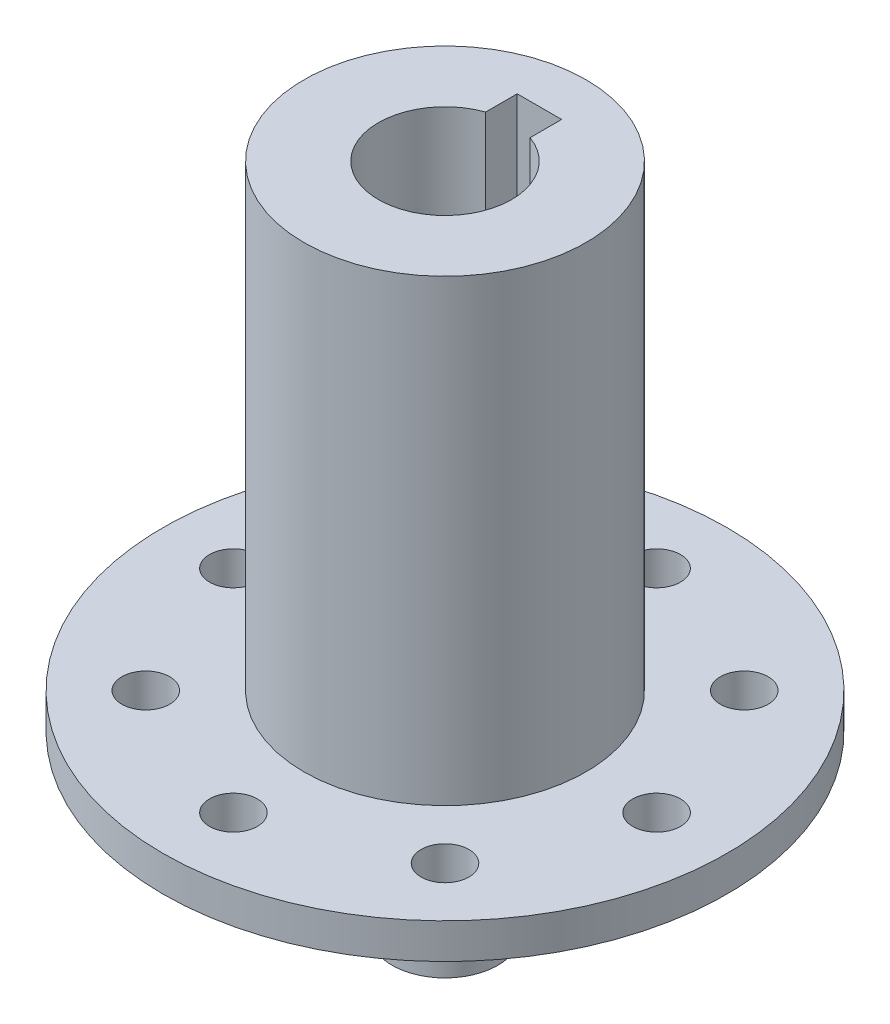
ISO-10303-21;
HEADER;
FILE_DESCRIPTION(('STEP AP214'),'2;1');
FILE_NAME('part.step','',(''),(''),'','','');
FILE_SCHEMA(('AUTOMOTIVE_DESIGN { 1 0 10303 214 1 1 1 1 }'));
ENDSEC;
DATA;
#1=APPLICATION_CONTEXT('core data for automotive mechanical design processes');
#2=APPLICATION_PROTOCOL_DEFINITION('international standard','automotive_design',2000,#1);
#3=PRODUCT_CONTEXT('',#1,'mechanical');
#4=PRODUCT('Part','Part','',(#3));
#5=PRODUCT_RELATED_PRODUCT_CATEGORY('part','',(#4));
#6=PRODUCT_DEFINITION_FORMATION('','',#4);
#7=PRODUCT_DEFINITION_CONTEXT('part definition',#1,'design');
#8=PRODUCT_DEFINITION('design','',#6,#7);
#9=PRODUCT_DEFINITION_SHAPE('','',#8);
#10=(LENGTH_UNIT() NAMED_UNIT(*) SI_UNIT(.MILLI.,.METRE.));
#11=(NAMED_UNIT(*) PLANE_ANGLE_UNIT() SI_UNIT($,.RADIAN.));
#12=(NAMED_UNIT(*) SI_UNIT($,.STERADIAN.) SOLID_ANGLE_UNIT());
#13=UNCERTAINTY_MEASURE_WITH_UNIT(LENGTH_MEASURE(1.E-05),#10,'distance_accuracy_value','');
#14=(GEOMETRIC_REPRESENTATION_CONTEXT(3) GLOBAL_UNCERTAINTY_ASSIGNED_CONTEXT((#13)) GLOBAL_UNIT_ASSIGNED_CONTEXT((#10,
#11,#12)) REPRESENTATION_CONTEXT('',''));
#15=CARTESIAN_POINT('',(0.,0.,0.));
#16=DIRECTION('',(0.,0.,1.));
#17=DIRECTION('',(1.,0.,0.));
#18=AXIS2_PLACEMENT_3D('',#15,#16,#17);
#19=CARTESIAN_POINT('',(0.,41.275,0.));
#20=DIRECTION('',(0.,-1.,0.));
#21=DIRECTION('',(0.,0.,-1.));
#22=AXIS2_PLACEMENT_3D('',#19,#20,#21);
#23=CYLINDRICAL_SURFACE('',#22,12.7);
#24=CARTESIAN_POINT('',(0.,41.275,0.));
#25=DIRECTION('',(0.,1.,0.));
#26=DIRECTION('',(0.,0.,1.));
#27=AXIS2_PLACEMENT_3D('',#24,#25,#26);
#28=CIRCLE('',#27,12.7);
#29=CARTESIAN_POINT('',(0.,41.275,12.7));
#30=VERTEX_POINT('',#29);
#31=EDGE_CURVE('E169',#30,#30,#28,.T.);
#32=ORIENTED_EDGE('',*,*,#31,.F.);
#33=EDGE_LOOP('',(#32));
#34=FACE_BOUND('',#33,.T.);
#35=CARTESIAN_POINT('',(0.,0.,0.));
#36=DIRECTION('',(0.,1.,0.));
#37=DIRECTION('',(0.,0.,1.));
#38=AXIS2_PLACEMENT_3D('',#35,#36,#37);
#39=CIRCLE('',#38,12.7);
#40=CARTESIAN_POINT('',(0.,0.,12.7));
#41=VERTEX_POINT('',#40);
#42=EDGE_CURVE('E165',#41,#41,#39,.T.);
#43=ORIENTED_EDGE('',*,*,#42,.T.);
#44=EDGE_LOOP('',(#43));
#45=FACE_BOUND('',#44,.T.);
#46=ADVANCED_FACE('F44',(#34,#45),#23,.T.);
#47=CARTESIAN_POINT('',(0.,41.275,0.));
#48=DIRECTION('',(0.,1.,0.));
#49=DIRECTION('',(0.,0.,1.));
#50=AXIS2_PLACEMENT_3D('',#47,#48,#49);
#51=PLANE('',#50);
#52=CARTESIAN_POINT('',(0.,41.275,0.));
#53=DIRECTION('',(0.,1.,0.));
#54=DIRECTION('',(0.,0.,1.));
#55=AXIS2_PLACEMENT_3D('',#52,#53,#54);
#56=CIRCLE('',#55,6.);
#57=CARTESIAN_POINT('',(-2.,41.275,-5.65685424949238));
#58=VERTEX_POINT('',#57);
#59=CARTESIAN_POINT('',(2.,41.275,-5.65685424949238));
#60=VERTEX_POINT('',#59);
#61=EDGE_CURVE('E59',#58,#60,#56,.T.);
#62=ORIENTED_EDGE('',*,*,#61,.F.);
#63=DIRECTION('',(0.,0.,1.));
#64=VECTOR('',#63,1.);
#65=CARTESIAN_POINT('',(-2.,41.275,-8.5));
#66=LINE('',#65,#64);
#67=CARTESIAN_POINT('',(-2.,41.275,-8.5));
#68=VERTEX_POINT('',#67);
#69=EDGE_CURVE('E110',#68,#58,#66,.T.);
#70=ORIENTED_EDGE('',*,*,#69,.F.);
#71=DIRECTION('',(-1.,0.,0.));
#72=VECTOR('',#71,1.);
#73=CARTESIAN_POINT('',(-2.,41.275,-8.5));
#74=LINE('',#73,#72);
#75=CARTESIAN_POINT('',(2.,41.275,-8.5));
#76=VERTEX_POINT('',#75);
#77=EDGE_CURVE('E118',#76,#68,#74,.T.);
#78=ORIENTED_EDGE('',*,*,#77,.F.);
#79=DIRECTION('',(0.,0.,-1.));
#80=VECTOR('',#79,1.);
#81=CARTESIAN_POINT('',(2.,41.275,-8.5));
#82=LINE('',#81,#80);
#83=EDGE_CURVE('E94',#60,#76,#82,.T.);
#84=ORIENTED_EDGE('',*,*,#83,.F.);
#85=EDGE_LOOP('',(#62,#70,#78,#84));
#86=FACE_BOUND('',#85,.T.);
#87=ORIENTED_EDGE('',*,*,#31,.T.);
#88=EDGE_LOOP('',(#87));
#89=FACE_BOUND('',#88,.T.);
#90=ADVANCED_FACE('F199',(#86,#89),#51,.T.);
#91=CARTESIAN_POINT('',(0.,-3.175,0.));
#92=DIRECTION('',(0.,1.,0.));
#93=DIRECTION('',(0.,0.,1.));
#94=AXIS2_PLACEMENT_3D('',#91,#92,#93);
#95=CYLINDRICAL_SURFACE('',#94,25.4);
#96=CARTESIAN_POINT('',(0.,-3.175,0.));
#97=DIRECTION('',(0.,-1.,0.));
#98=DIRECTION('',(0.,0.,-1.));
#99=AXIS2_PLACEMENT_3D('',#96,#97,#98);
#100=CIRCLE('',#99,25.4);
#101=CARTESIAN_POINT('',(0.,-3.175,-25.4));
#102=VERTEX_POINT('',#101);
#103=EDGE_CURVE('E162',#102,#102,#100,.T.);
#104=ORIENTED_EDGE('',*,*,#103,.F.);
#105=EDGE_LOOP('',(#104));
#106=FACE_BOUND('',#105,.T.);
#107=CARTESIAN_POINT('',(0.,0.,0.));
#108=DIRECTION('',(0.,-1.,0.));
#109=DIRECTION('',(0.,0.,-1.));
#110=AXIS2_PLACEMENT_3D('',#107,#108,#109);
#111=CIRCLE('',#110,25.4);
#112=CARTESIAN_POINT('',(0.,0.,-25.4));
#113=VERTEX_POINT('',#112);
#114=EDGE_CURVE('E166',#113,#113,#111,.T.);
#115=ORIENTED_EDGE('',*,*,#114,.T.);
#116=EDGE_LOOP('',(#115));
#117=FACE_BOUND('',#116,.T.);
#118=ADVANCED_FACE('F204',(#106,#117),#95,.T.);
#119=CARTESIAN_POINT('',(0.,-3.175,0.));
#120=DIRECTION('',(0.,-1.,0.));
#121=DIRECTION('',(0.,0.,-1.));
#122=AXIS2_PLACEMENT_3D('',#119,#120,#121);
#123=PLANE('',#122);
#124=CARTESIAN_POINT('',(0.,-3.175,0.));
#125=DIRECTION('',(0.,-1.,0.));
#126=DIRECTION('',(0.,0.,-1.));
#127=AXIS2_PLACEMENT_3D('',#124,#125,#126);
#128=CIRCLE('',#127,9.7625);
#129=CARTESIAN_POINT('',(0.,-3.175,-9.7625));
#130=VERTEX_POINT('',#129);
#131=EDGE_CURVE('E13',#130,#130,#128,.F.);
#132=ORIENTED_EDGE('',*,*,#131,.T.);
#133=EDGE_LOOP('',(#132));
#134=FACE_BOUND('',#133,.T.);
#135=CARTESIAN_POINT('',(0.,-3.175,-19.05));
#136=DIRECTION('',(0.,-1.,0.));
#137=DIRECTION('',(0.,0.,-1.));
#138=AXIS2_PLACEMENT_3D('',#135,#136,#137);
#139=CIRCLE('',#138,2.15264999999999);
#140=CARTESIAN_POINT('',(0.,-3.175,-21.20265));
#141=VERTEX_POINT('',#140);
#142=EDGE_CURVE('E122',#141,#141,#139,.T.);
#143=ORIENTED_EDGE('',*,*,#142,.F.);
#144=EDGE_LOOP('',(#143));
#145=FACE_BOUND('',#144,.T.);
#146=CARTESIAN_POINT('',(13.4703841816038,-3.175,-13.4703841816037));
#147=DIRECTION('',(0.,-1.,0.));
#148=DIRECTION('',(0.,0.,-1.));
#149=AXIS2_PLACEMENT_3D('',#146,#147,#148);
#150=CIRCLE('',#149,2.15265);
#151=CARTESIAN_POINT('',(13.4703841816038,-3.175,-15.6230341816037));
#152=VERTEX_POINT('',#151);
#153=EDGE_CURVE('E128',#152,#152,#150,.T.);
#154=ORIENTED_EDGE('',*,*,#153,.F.);
#155=EDGE_LOOP('',(#154));
#156=FACE_BOUND('',#155,.T.);
#157=CARTESIAN_POINT('',(19.05,-3.175,0.));
#158=DIRECTION('',(0.,-1.,0.));
#159=DIRECTION('',(0.,0.,-1.));
#160=AXIS2_PLACEMENT_3D('',#157,#158,#159);
#161=CIRCLE('',#160,2.15265);
#162=CARTESIAN_POINT('',(19.05,-3.175,-2.15264999999999));
#163=VERTEX_POINT('',#162);
#164=EDGE_CURVE('E134',#163,#163,#161,.T.);
#165=ORIENTED_EDGE('',*,*,#164,.F.);
#166=EDGE_LOOP('',(#165));
#167=FACE_BOUND('',#166,.T.);
#168=CARTESIAN_POINT('',(13.4703841816037,-3.175,13.4703841816038));
#169=DIRECTION('',(0.,-1.,0.));
#170=DIRECTION('',(0.,0.,-1.));
#171=AXIS2_PLACEMENT_3D('',#168,#169,#170);
#172=CIRCLE('',#171,2.15265);
#173=CARTESIAN_POINT('',(13.4703841816037,-3.175,11.3177341816038));
#174=VERTEX_POINT('',#173);
#175=EDGE_CURVE('E138',#174,#174,#172,.T.);
#176=ORIENTED_EDGE('',*,*,#175,.F.);
#177=EDGE_LOOP('',(#176));
#178=FACE_BOUND('',#177,.T.);
#179=CARTESIAN_POINT('',(0.,-3.175,19.05));
#180=DIRECTION('',(0.,-1.,0.));
#181=DIRECTION('',(0.,0.,-1.));
#182=AXIS2_PLACEMENT_3D('',#179,#180,#181);
#183=CIRCLE('',#182,2.15264999999999);
#184=CARTESIAN_POINT('',(0.,-3.175,16.89735));
#185=VERTEX_POINT('',#184);
#186=EDGE_CURVE('E144',#185,#185,#183,.T.);
#187=ORIENTED_EDGE('',*,*,#186,.F.);
#188=EDGE_LOOP('',(#187));
#189=FACE_BOUND('',#188,.T.);
#190=CARTESIAN_POINT('',(-13.4703841816038,-3.175,13.4703841816037));
#191=DIRECTION('',(0.,-1.,0.));
#192=DIRECTION('',(0.,0.,-1.));
#193=AXIS2_PLACEMENT_3D('',#190,#191,#192);
#194=CIRCLE('',#193,2.15265);
#195=CARTESIAN_POINT('',(-13.4703841816038,-3.175,11.3177341816037));
#196=VERTEX_POINT('',#195);
#197=EDGE_CURVE('E148',#196,#196,#194,.T.);
#198=ORIENTED_EDGE('',*,*,#197,.F.);
#199=EDGE_LOOP('',(#198));
#200=FACE_BOUND('',#199,.T.);
#201=CARTESIAN_POINT('',(-19.05,-3.175,0.));
#202=DIRECTION('',(0.,-1.,0.));
#203=DIRECTION('',(0.,0.,-1.));
#204=AXIS2_PLACEMENT_3D('',#201,#202,#203);
#205=CIRCLE('',#204,2.15265);
#206=CARTESIAN_POINT('',(-19.05,-3.175,-2.15265));
#207=VERTEX_POINT('',#206);
#208=EDGE_CURVE('E154',#207,#207,#205,.T.);
#209=ORIENTED_EDGE('',*,*,#208,.F.);
#210=EDGE_LOOP('',(#209));
#211=FACE_BOUND('',#210,.T.);
#212=CARTESIAN_POINT('',(-13.4703841816037,-3.175,-13.4703841816037));
#213=DIRECTION('',(0.,-1.,0.));
#214=DIRECTION('',(0.,0.,-1.));
#215=AXIS2_PLACEMENT_3D('',#212,#213,#214);
#216=CIRCLE('',#215,2.15265);
#217=CARTESIAN_POINT('',(-13.4703841816037,-3.175,-15.6230341816037));
#218=VERTEX_POINT('',#217);
#219=EDGE_CURVE('E158',#218,#218,#216,.T.);
#220=ORIENTED_EDGE('',*,*,#219,.F.);
#221=EDGE_LOOP('',(#220));
#222=FACE_BOUND('',#221,.T.);
#223=ORIENTED_EDGE('',*,*,#103,.T.);
#224=EDGE_LOOP('',(#223));
#225=FACE_BOUND('',#224,.T.);
#226=ADVANCED_FACE('F212',(#134,#145,#156,#167,#178,#189,#200,#211,#222,#225),#123,.T.);
#227=CARTESIAN_POINT('',(0.,0.,0.));
#228=DIRECTION('',(0.,-1.,0.));
#229=DIRECTION('',(0.,0.,-1.));
#230=AXIS2_PLACEMENT_3D('',#227,#228,#229);
#231=PLANE('',#230);
#232=CARTESIAN_POINT('',(0.,0.,-19.05));
#233=DIRECTION('',(0.,-1.,0.));
#234=DIRECTION('',(0.,0.,-1.));
#235=AXIS2_PLACEMENT_3D('',#232,#233,#234);
#236=CIRCLE('',#235,2.15264999999999);
#237=CARTESIAN_POINT('',(0.,0.,-21.20265));
#238=VERTEX_POINT('',#237);
#239=EDGE_CURVE('E127',#238,#238,#236,.T.);
#240=ORIENTED_EDGE('',*,*,#239,.T.);
#241=EDGE_LOOP('',(#240));
#242=FACE_BOUND('',#241,.T.);
#243=CARTESIAN_POINT('',(13.4703841816038,0.,-13.4703841816037));
#244=DIRECTION('',(0.,-1.,0.));
#245=DIRECTION('',(0.,0.,-1.));
#246=AXIS2_PLACEMENT_3D('',#243,#244,#245);
#247=CIRCLE('',#246,2.15264999999999);
#248=CARTESIAN_POINT('',(13.4703841816038,0.,-15.6230341816037));
#249=VERTEX_POINT('',#248);
#250=EDGE_CURVE('E131',#249,#249,#247,.T.);
#251=ORIENTED_EDGE('',*,*,#250,.T.);
#252=EDGE_LOOP('',(#251));
#253=FACE_BOUND('',#252,.T.);
#254=CARTESIAN_POINT('',(19.05,0.,0.));
#255=DIRECTION('',(0.,-1.,0.));
#256=DIRECTION('',(0.,0.,-1.));
#257=AXIS2_PLACEMENT_3D('',#254,#255,#256);
#258=CIRCLE('',#257,2.15264999999999);
#259=CARTESIAN_POINT('',(19.05,0.,-2.15264999999999));
#260=VERTEX_POINT('',#259);
#261=EDGE_CURVE('E137',#260,#260,#258,.T.);
#262=ORIENTED_EDGE('',*,*,#261,.T.);
#263=EDGE_LOOP('',(#262));
#264=FACE_BOUND('',#263,.T.);
#265=CARTESIAN_POINT('',(13.4703841816037,0.,13.4703841816038));
#266=DIRECTION('',(0.,-1.,0.));
#267=DIRECTION('',(0.,0.,-1.));
#268=AXIS2_PLACEMENT_3D('',#265,#266,#267);
#269=CIRCLE('',#268,2.15264999999999);
#270=CARTESIAN_POINT('',(13.4703841816037,0.,11.3177341816038));
#271=VERTEX_POINT('',#270);
#272=EDGE_CURVE('E141',#271,#271,#269,.T.);
#273=ORIENTED_EDGE('',*,*,#272,.T.);
#274=EDGE_LOOP('',(#273));
#275=FACE_BOUND('',#274,.T.);
#276=CARTESIAN_POINT('',(0.,0.,19.05));
#277=DIRECTION('',(0.,-1.,0.));
#278=DIRECTION('',(0.,0.,-1.));
#279=AXIS2_PLACEMENT_3D('',#276,#277,#278);
#280=CIRCLE('',#279,2.15264999999999);
#281=CARTESIAN_POINT('',(0.,0.,16.89735));
#282=VERTEX_POINT('',#281);
#283=EDGE_CURVE('E147',#282,#282,#280,.T.);
#284=ORIENTED_EDGE('',*,*,#283,.T.);
#285=EDGE_LOOP('',(#284));
#286=FACE_BOUND('',#285,.T.);
#287=CARTESIAN_POINT('',(-13.4703841816038,0.,13.4703841816037));
#288=DIRECTION('',(0.,-1.,0.));
#289=DIRECTION('',(0.,0.,-1.));
#290=AXIS2_PLACEMENT_3D('',#287,#288,#289);
#291=CIRCLE('',#290,2.15264999999999);
#292=CARTESIAN_POINT('',(-13.4703841816038,0.,11.3177341816037));
#293=VERTEX_POINT('',#292);
#294=EDGE_CURVE('E151',#293,#293,#291,.T.);
#295=ORIENTED_EDGE('',*,*,#294,.T.);
#296=EDGE_LOOP('',(#295));
#297=FACE_BOUND('',#296,.T.);
#298=CARTESIAN_POINT('',(-19.05,0.,0.));
#299=DIRECTION('',(0.,-1.,0.));
#300=DIRECTION('',(0.,0.,-1.));
#301=AXIS2_PLACEMENT_3D('',#298,#299,#300);
#302=CIRCLE('',#301,2.15264999999999);
#303=CARTESIAN_POINT('',(-19.05,0.,-2.15265));
#304=VERTEX_POINT('',#303);
#305=EDGE_CURVE('E157',#304,#304,#302,.T.);
#306=ORIENTED_EDGE('',*,*,#305,.T.);
#307=EDGE_LOOP('',(#306));
#308=FACE_BOUND('',#307,.T.);
#309=CARTESIAN_POINT('',(-13.4703841816037,0.,-13.4703841816037));
#310=DIRECTION('',(0.,-1.,0.));
#311=DIRECTION('',(0.,0.,-1.));
#312=AXIS2_PLACEMENT_3D('',#309,#310,#311);
#313=CIRCLE('',#312,2.15264999999999);
#314=CARTESIAN_POINT('',(-13.4703841816037,0.,-15.6230341816037));
#315=VERTEX_POINT('',#314);
#316=EDGE_CURVE('E161',#315,#315,#313,.T.);
#317=ORIENTED_EDGE('',*,*,#316,.T.);
#318=EDGE_LOOP('',(#317));
#319=FACE_BOUND('',#318,.T.);
#320=ORIENTED_EDGE('',*,*,#42,.F.);
#321=EDGE_LOOP('',(#320));
#322=FACE_BOUND('',#321,.T.);
#323=ORIENTED_EDGE('',*,*,#114,.F.);
#324=EDGE_LOOP('',(#323));
#325=FACE_BOUND('',#324,.T.);
#326=ADVANCED_FACE('F214',(#242,#253,#264,#275,#286,#297,#308,#319,#322,#325),#231,.F.);
#327=CARTESIAN_POINT('',(-13.4703841816037,-3.175,-13.4703841816037));
#328=DIRECTION('',(0.,-1.,0.));
#329=DIRECTION('',(0.,0.,-1.));
#330=AXIS2_PLACEMENT_3D('',#327,#328,#329);
#331=CYLINDRICAL_SURFACE('',#330,2.15264999999999);
#332=ORIENTED_EDGE('',*,*,#219,.T.);
#333=EDGE_LOOP('',(#332));
#334=FACE_BOUND('',#333,.T.);
#335=ORIENTED_EDGE('',*,*,#316,.F.);
#336=EDGE_LOOP('',(#335));
#337=FACE_BOUND('',#336,.T.);
#338=ADVANCED_FACE('F217',(#334,#337),#331,.F.);
#339=CARTESIAN_POINT('',(-19.05,-3.175,0.));
#340=DIRECTION('',(0.,-1.,0.));
#341=DIRECTION('',(0.,0.,-1.));
#342=AXIS2_PLACEMENT_3D('',#339,#340,#341);
#343=CYLINDRICAL_SURFACE('',#342,2.15264999999999);
#344=ORIENTED_EDGE('',*,*,#208,.T.);
#345=EDGE_LOOP('',(#344));
#346=FACE_BOUND('',#345,.T.);
#347=ORIENTED_EDGE('',*,*,#305,.F.);
#348=EDGE_LOOP('',(#347));
#349=FACE_BOUND('',#348,.T.);
#350=ADVANCED_FACE('F224',(#346,#349),#343,.F.);
#351=CARTESIAN_POINT('',(-13.4703841816038,-3.175,13.4703841816037));
#352=DIRECTION('',(0.,-1.,0.));
#353=DIRECTION('',(0.,0.,-1.));
#354=AXIS2_PLACEMENT_3D('',#351,#352,#353);
#355=CYLINDRICAL_SURFACE('',#354,2.15264999999999);
#356=ORIENTED_EDGE('',*,*,#197,.T.);
#357=EDGE_LOOP('',(#356));
#358=FACE_BOUND('',#357,.T.);
#359=ORIENTED_EDGE('',*,*,#294,.F.);
#360=EDGE_LOOP('',(#359));
#361=FACE_BOUND('',#360,.T.);
#362=ADVANCED_FACE('F228',(#358,#361),#355,.F.);
#363=CARTESIAN_POINT('',(0.,-3.175,19.05));
#364=DIRECTION('',(0.,-1.,0.));
#365=DIRECTION('',(0.,0.,-1.));
#366=AXIS2_PLACEMENT_3D('',#363,#364,#365);
#367=CYLINDRICAL_SURFACE('',#366,2.15264999999999);
#368=ORIENTED_EDGE('',*,*,#186,.T.);
#369=EDGE_LOOP('',(#368));
#370=FACE_BOUND('',#369,.T.);
#371=ORIENTED_EDGE('',*,*,#283,.F.);
#372=EDGE_LOOP('',(#371));
#373=FACE_BOUND('',#372,.T.);
#374=ADVANCED_FACE('F232',(#370,#373),#367,.F.);
#375=CARTESIAN_POINT('',(13.4703841816037,-3.175,13.4703841816038));
#376=DIRECTION('',(0.,-1.,0.));
#377=DIRECTION('',(0.,0.,-1.));
#378=AXIS2_PLACEMENT_3D('',#375,#376,#377);
#379=CYLINDRICAL_SURFACE('',#378,2.15264999999999);
#380=ORIENTED_EDGE('',*,*,#175,.T.);
#381=EDGE_LOOP('',(#380));
#382=FACE_BOUND('',#381,.T.);
#383=ORIENTED_EDGE('',*,*,#272,.F.);
#384=EDGE_LOOP('',(#383));
#385=FACE_BOUND('',#384,.T.);
#386=ADVANCED_FACE('F236',(#382,#385),#379,.F.);
#387=CARTESIAN_POINT('',(19.05,-3.175,0.));
#388=DIRECTION('',(0.,-1.,0.));
#389=DIRECTION('',(0.,0.,-1.));
#390=AXIS2_PLACEMENT_3D('',#387,#388,#389);
#391=CYLINDRICAL_SURFACE('',#390,2.15264999999999);
#392=ORIENTED_EDGE('',*,*,#164,.T.);
#393=EDGE_LOOP('',(#392));
#394=FACE_BOUND('',#393,.T.);
#395=ORIENTED_EDGE('',*,*,#261,.F.);
#396=EDGE_LOOP('',(#395));
#397=FACE_BOUND('',#396,.T.);
#398=ADVANCED_FACE('F240',(#394,#397),#391,.F.);
#399=CARTESIAN_POINT('',(13.4703841816038,-3.175,-13.4703841816037));
#400=DIRECTION('',(0.,-1.,0.));
#401=DIRECTION('',(0.,0.,-1.));
#402=AXIS2_PLACEMENT_3D('',#399,#400,#401);
#403=CYLINDRICAL_SURFACE('',#402,2.15264999999999);
#404=ORIENTED_EDGE('',*,*,#153,.T.);
#405=EDGE_LOOP('',(#404));
#406=FACE_BOUND('',#405,.T.);
#407=ORIENTED_EDGE('',*,*,#250,.F.);
#408=EDGE_LOOP('',(#407));
#409=FACE_BOUND('',#408,.T.);
#410=ADVANCED_FACE('F244',(#406,#409),#403,.F.);
#411=CARTESIAN_POINT('',(0.,-3.175,-19.05));
#412=DIRECTION('',(0.,-1.,0.));
#413=DIRECTION('',(0.,0.,-1.));
#414=AXIS2_PLACEMENT_3D('',#411,#412,#413);
#415=CYLINDRICAL_SURFACE('',#414,2.15264999999999);
#416=ORIENTED_EDGE('',*,*,#142,.T.);
#417=EDGE_LOOP('',(#416));
#418=FACE_BOUND('',#417,.T.);
#419=ORIENTED_EDGE('',*,*,#239,.F.);
#420=EDGE_LOOP('',(#419));
#421=FACE_BOUND('',#420,.T.);
#422=ADVANCED_FACE('F248',(#418,#421),#415,.F.);
#423=CARTESIAN_POINT('',(0.,19.2125,0.));
#424=DIRECTION('',(0.,1.,0.));
#425=DIRECTION('',(0.,0.,1.));
#426=AXIS2_PLACEMENT_3D('',#423,#424,#425);
#427=CYLINDRICAL_SURFACE('',#426,6.);
#428=ORIENTED_EDGE('',*,*,#61,.T.);
#429=DIRECTION('',(0.,1.,0.));
#430=VECTOR('',#429,1.);
#431=CARTESIAN_POINT('',(2.,19.2125,-5.65685424949238));
#432=LINE('',#431,#430);
#433=CARTESIAN_POINT('',(2.,19.2125,-5.65685424949238));
#434=VERTEX_POINT('',#433);
#435=EDGE_CURVE('E82',#434,#60,#432,.T.);
#436=ORIENTED_EDGE('',*,*,#435,.F.);
#437=CARTESIAN_POINT('',(0.,19.2125,0.));
#438=DIRECTION('',(0.,1.,0.));
#439=DIRECTION('',(0.,0.,1.));
#440=AXIS2_PLACEMENT_3D('',#437,#438,#439);
#441=CIRCLE('',#440,6.);
#442=CARTESIAN_POINT('',(-2.,19.2125,-5.65685424949238));
#443=VERTEX_POINT('',#442);
#444=EDGE_CURVE('E108',#443,#434,#441,.T.);
#445=ORIENTED_EDGE('',*,*,#444,.F.);
#446=DIRECTION('',(0.,1.,0.));
#447=VECTOR('',#446,1.);
#448=CARTESIAN_POINT('',(-2.,19.2125,-5.65685424949238));
#449=LINE('',#448,#447);
#450=EDGE_CURVE('E67',#443,#58,#449,.T.);
#451=ORIENTED_EDGE('',*,*,#450,.T.);
#452=EDGE_LOOP('',(#428,#436,#445,#451));
#453=FACE_BOUND('',#452,.T.);
#454=ADVANCED_FACE('F252',(#453),#427,.F.);
#455=CARTESIAN_POINT('',(-2.,19.2125,-8.5));
#456=DIRECTION('',(-1.,0.,0.));
#457=DIRECTION('',(0.,0.,1.));
#458=AXIS2_PLACEMENT_3D('',#455,#456,#457);
#459=PLANE('',#458);
#460=ORIENTED_EDGE('',*,*,#69,.T.);
#461=ORIENTED_EDGE('',*,*,#450,.F.);
#462=DIRECTION('',(0.,0.,1.));
#463=VECTOR('',#462,1.);
#464=CARTESIAN_POINT('',(-2.,19.2125,-8.5));
#465=LINE('',#464,#463);
#466=CARTESIAN_POINT('',(-2.,19.2125,-8.5));
#467=VERTEX_POINT('',#466);
#468=EDGE_CURVE('E105',#467,#443,#465,.T.);
#469=ORIENTED_EDGE('',*,*,#468,.F.);
#470=DIRECTION('',(0.,1.,0.));
#471=VECTOR('',#470,1.);
#472=CARTESIAN_POINT('',(-2.,19.2125,-8.5));
#473=LINE('',#472,#471);
#474=EDGE_CURVE('E98',#467,#68,#473,.T.);
#475=ORIENTED_EDGE('',*,*,#474,.T.);
#476=EDGE_LOOP('',(#460,#461,#469,#475));
#477=FACE_BOUND('',#476,.T.);
#478=ADVANCED_FACE('F256',(#477),#459,.F.);
#479=CARTESIAN_POINT('',(-2.,19.2125,-8.5));
#480=DIRECTION('',(0.,0.,-1.));
#481=DIRECTION('',(-1.,0.,0.));
#482=AXIS2_PLACEMENT_3D('',#479,#480,#481);
#483=PLANE('',#482);
#484=ORIENTED_EDGE('',*,*,#77,.T.);
#485=ORIENTED_EDGE('',*,*,#474,.F.);
#486=DIRECTION('',(-1.,0.,0.));
#487=VECTOR('',#486,1.);
#488=CARTESIAN_POINT('',(-2.,19.2125,-8.5));
#489=LINE('',#488,#487);
#490=CARTESIAN_POINT('',(2.,19.2125,-8.5));
#491=VERTEX_POINT('',#490);
#492=EDGE_CURVE('E101',#491,#467,#489,.T.);
#493=ORIENTED_EDGE('',*,*,#492,.F.);
#494=DIRECTION('',(0.,1.,0.));
#495=VECTOR('',#494,1.);
#496=CARTESIAN_POINT('',(2.,19.2125,-8.5));
#497=LINE('',#496,#495);
#498=EDGE_CURVE('E87',#491,#76,#497,.T.);
#499=ORIENTED_EDGE('',*,*,#498,.T.);
#500=EDGE_LOOP('',(#484,#485,#493,#499));
#501=FACE_BOUND('',#500,.T.);
#502=ADVANCED_FACE('F102',(#501),#483,.F.);
#503=CARTESIAN_POINT('',(2.,19.2125,-8.5));
#504=DIRECTION('',(1.,0.,0.));
#505=DIRECTION('',(0.,0.,-1.));
#506=AXIS2_PLACEMENT_3D('',#503,#504,#505);
#507=PLANE('',#506);
#508=ORIENTED_EDGE('',*,*,#83,.T.);
#509=ORIENTED_EDGE('',*,*,#498,.F.);
#510=DIRECTION('',(0.,0.,-1.));
#511=VECTOR('',#510,1.);
#512=CARTESIAN_POINT('',(2.,19.2125,-8.5));
#513=LINE('',#512,#511);
#514=EDGE_CURVE('E91',#434,#491,#513,.T.);
#515=ORIENTED_EDGE('',*,*,#514,.F.);
#516=ORIENTED_EDGE('',*,*,#435,.T.);
#517=EDGE_LOOP('',(#508,#509,#515,#516));
#518=FACE_BOUND('',#517,.T.);
#519=ADVANCED_FACE('F89',(#518),#507,.F.);
#520=CARTESIAN_POINT('',(0.,19.2125,0.));
#521=DIRECTION('',(0.,1.,0.));
#522=DIRECTION('',(0.,0.,1.));
#523=AXIS2_PLACEMENT_3D('',#520,#521,#522);
#524=PLANE('',#523);
#525=ORIENTED_EDGE('',*,*,#444,.T.);
#526=ORIENTED_EDGE('',*,*,#514,.T.);
#527=ORIENTED_EDGE('',*,*,#492,.T.);
#528=ORIENTED_EDGE('',*,*,#468,.T.);
#529=EDGE_LOOP('',(#525,#526,#527,#528));
#530=FACE_BOUND('',#529,.T.);
#531=ADVANCED_FACE('F107',(#530),#524,.T.);
#532=CARTESIAN_POINT('',(0.,-19.05,0.));
#533=DIRECTION('',(0.,1.,0.));
#534=DIRECTION('',(0.,0.,1.));
#535=AXIS2_PLACEMENT_3D('',#532,#533,#534);
#536=CYLINDRICAL_SURFACE('',#535,4.7625);
#537=CARTESIAN_POINT('',(0.,-8.175,0.));
#538=DIRECTION('',(0.,-1.,0.));
#539=DIRECTION('',(0.,0.,-1.));
#540=AXIS2_PLACEMENT_3D('',#537,#538,#539);
#541=CIRCLE('',#540,4.7625);
#542=CARTESIAN_POINT('',(0.,-8.175,-4.7625));
#543=VERTEX_POINT('',#542);
#544=EDGE_CURVE('E52',#543,#543,#541,.T.);
#545=ORIENTED_EDGE('',*,*,#544,.T.);
#546=EDGE_LOOP('',(#545));
#547=FACE_BOUND('',#546,.T.);
#548=CARTESIAN_POINT('',(0.,-19.05,0.));
#549=DIRECTION('',(0.,-1.,0.));
#550=DIRECTION('',(0.,0.,-1.));
#551=AXIS2_PLACEMENT_3D('',#548,#549,#550);
#552=CIRCLE('',#551,4.7625);
#553=CARTESIAN_POINT('',(0.,-19.05,-4.7625));
#554=VERTEX_POINT('',#553);
#555=EDGE_CURVE('E116',#554,#554,#552,.T.);
#556=ORIENTED_EDGE('',*,*,#555,.F.);
#557=EDGE_LOOP('',(#556));
#558=FACE_BOUND('',#557,.T.);
#559=ADVANCED_FACE('F186',(#547,#558),#536,.T.);
#560=CARTESIAN_POINT('',(0.,-19.05,0.));
#561=DIRECTION('',(0.,-1.,0.));
#562=DIRECTION('',(0.,0.,-1.));
#563=AXIS2_PLACEMENT_3D('',#560,#561,#562);
#564=PLANE('',#563);
#565=ORIENTED_EDGE('',*,*,#555,.T.);
#566=EDGE_LOOP('',(#565));
#567=FACE_BOUND('',#566,.T.);
#568=ADVANCED_FACE('F190',(#567),#564,.T.);
#569=CARTESIAN_POINT('',(0.,-8.175,0.));
#570=DIRECTION('',(0.,-1.,0.));
#571=DIRECTION('',(0.,0.,-1.));
#572=AXIS2_PLACEMENT_3D('',#569,#570,#571);
#573=TOROIDAL_SURFACE('',#572,9.7625,5.);
#574=ORIENTED_EDGE('',*,*,#131,.F.);
#575=EDGE_LOOP('',(#574));
#576=FACE_BOUND('',#575,.T.);
#577=ORIENTED_EDGE('',*,*,#544,.F.);
#578=EDGE_LOOP('',(#577));
#579=FACE_BOUND('',#578,.T.);
#580=ADVANCED_FACE('F46',(#576,#579),#573,.F.);
#581=CLOSED_SHELL('',(#46,#90,#118,#226,#326,#338,#350,#362,#374,#386,#398,#410,#422,#454,#478,
#502,#519,#531,#559,#568,#580));
#582=MANIFOLD_SOLID_BREP('B2',#581);
#583=ADVANCED_BREP_SHAPE_REPRESENTATION('',(#18,#582),#14);
#584=SHAPE_DEFINITION_REPRESENTATION(#9,#583);
ENDSEC;
END-ISO-10303-21;
